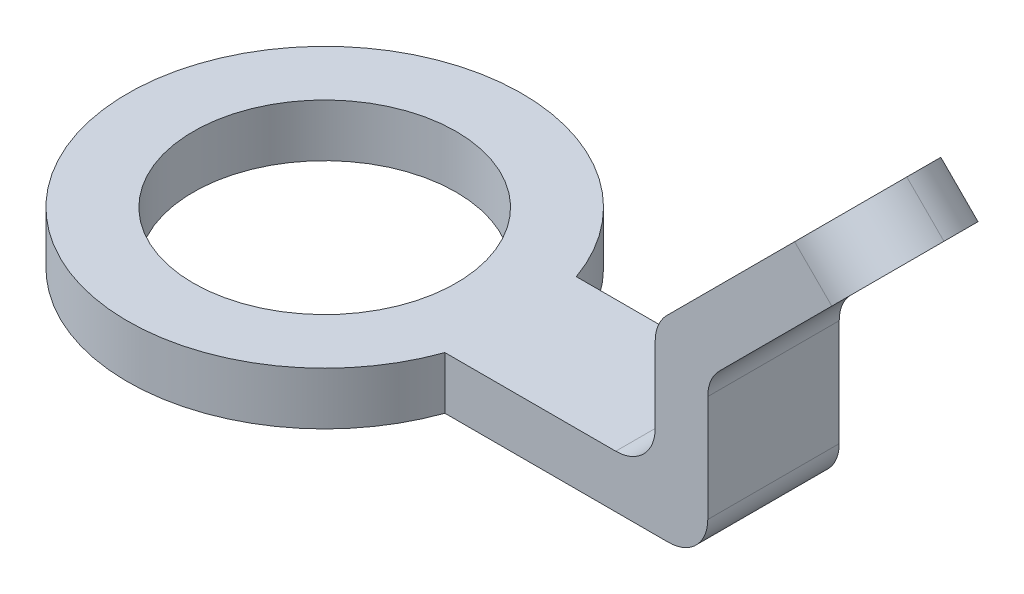
ISO-10303-21;
HEADER;
FILE_DESCRIPTION(('STEP AP214'),'2;1');
FILE_NAME('part.step','',(''),(''),'','','');
FILE_SCHEMA(('AUTOMOTIVE_DESIGN { 1 0 10303 214 1 1 1 1 }'));
ENDSEC;
DATA;
#1=APPLICATION_CONTEXT('core data for automotive mechanical design processes');
#2=APPLICATION_PROTOCOL_DEFINITION('international standard','automotive_design',2000,#1);
#3=PRODUCT_CONTEXT('',#1,'mechanical');
#4=PRODUCT('Part','Part','',(#3));
#5=PRODUCT_RELATED_PRODUCT_CATEGORY('part','',(#4));
#6=PRODUCT_DEFINITION_FORMATION('','',#4);
#7=PRODUCT_DEFINITION_CONTEXT('part definition',#1,'design');
#8=PRODUCT_DEFINITION('design','',#6,#7);
#9=PRODUCT_DEFINITION_SHAPE('','',#8);
#10=(LENGTH_UNIT() NAMED_UNIT(*) SI_UNIT(.MILLI.,.METRE.));
#11=(NAMED_UNIT(*) PLANE_ANGLE_UNIT() SI_UNIT($,.RADIAN.));
#12=(NAMED_UNIT(*) SI_UNIT($,.STERADIAN.) SOLID_ANGLE_UNIT());
#13=UNCERTAINTY_MEASURE_WITH_UNIT(LENGTH_MEASURE(1.E-05),#10,'distance_accuracy_value','');
#14=(GEOMETRIC_REPRESENTATION_CONTEXT(3) GLOBAL_UNCERTAINTY_ASSIGNED_CONTEXT((#13)) GLOBAL_UNIT_ASSIGNED_CONTEXT((#10,
#11,#12)) REPRESENTATION_CONTEXT('',''));
#15=CARTESIAN_POINT('',(0.,0.,0.));
#16=DIRECTION('',(0.,0.,1.));
#17=DIRECTION('',(1.,0.,0.));
#18=AXIS2_PLACEMENT_3D('',#15,#16,#17);
#19=CARTESIAN_POINT('',(0.,4.,0.));
#20=DIRECTION('',(0.,1.,0.));
#21=DIRECTION('',(0.,0.,1.));
#22=AXIS2_PLACEMENT_3D('',#19,#20,#21);
#23=PLANE('',#22);
#24=DIRECTION('',(1.,0.,0.));
#25=VECTOR('',#24,1.);
#26=CARTESIAN_POINT('',(34.142135623731,4.,5.));
#27=LINE('',#26,#25);
#28=CARTESIAN_POINT('',(14.1421356237309,4.,5.00000000000001));
#29=VERTEX_POINT('',#28);
#30=CARTESIAN_POINT('',(27.142135623731,4.,5.00000000000001));
#31=VERTEX_POINT('',#30);
#32=EDGE_CURVE('E147',#29,#31,#27,.T.);
#33=ORIENTED_EDGE('',*,*,#32,.T.);
#34=DIRECTION('',(0.,0.,1.));
#35=VECTOR('',#34,1.);
#36=CARTESIAN_POINT('',(27.142135623731,4.,-4.99999999999999));
#37=LINE('',#36,#35);
#38=CARTESIAN_POINT('',(27.142135623731,4.,-4.99999999999999));
#39=VERTEX_POINT('',#38);
#40=EDGE_CURVE('E54',#31,#39,#37,.F.);
#41=ORIENTED_EDGE('',*,*,#40,.T.);
#42=DIRECTION('',(-1.,0.,0.));
#43=VECTOR('',#42,1.);
#44=CARTESIAN_POINT('',(34.142135623731,4.,-4.99999999999999));
#45=LINE('',#44,#43);
#46=CARTESIAN_POINT('',(14.142135623731,4.,-4.99999999999999));
#47=VERTEX_POINT('',#46);
#48=EDGE_CURVE('E131',#39,#47,#45,.T.);
#49=ORIENTED_EDGE('',*,*,#48,.T.);
#50=CARTESIAN_POINT('',(0.,4.,0.));
#51=DIRECTION('',(0.,1.,0.));
#52=DIRECTION('',(0.,0.,1.));
#53=AXIS2_PLACEMENT_3D('',#50,#51,#52);
#54=CIRCLE('',#53,15.);
#55=EDGE_CURVE('E134',#47,#29,#54,.T.);
#56=ORIENTED_EDGE('',*,*,#55,.T.);
#57=EDGE_LOOP('',(#33,#41,#49,#56));
#58=FACE_BOUND('',#57,.T.);
#59=CARTESIAN_POINT('',(0.,4.,0.));
#60=DIRECTION('',(0.,1.,0.));
#61=DIRECTION('',(0.,0.,1.));
#62=AXIS2_PLACEMENT_3D('',#59,#60,#61);
#63=CIRCLE('',#62,10.);
#64=CARTESIAN_POINT('',(0.,4.,10.));
#65=VERTEX_POINT('',#64);
#66=EDGE_CURVE('E226',#65,#65,#63,.T.);
#67=ORIENTED_EDGE('',*,*,#66,.F.);
#68=EDGE_LOOP('',(#67));
#69=FACE_BOUND('',#68,.T.);
#70=ADVANCED_FACE('F39',(#58,#69),#23,.T.);
#71=CARTESIAN_POINT('',(0.,0.,0.));
#72=DIRECTION('',(0.,1.,0.));
#73=DIRECTION('',(0.,0.,1.));
#74=AXIS2_PLACEMENT_3D('',#71,#72,#73);
#75=PLANE('',#74);
#76=DIRECTION('',(-1.,0.,0.));
#77=VECTOR('',#76,1.);
#78=CARTESIAN_POINT('',(34.142135623731,0.,-4.99999999999999));
#79=LINE('',#78,#77);
#80=CARTESIAN_POINT('',(31.142135623731,0.,-4.99999999999999));
#81=VERTEX_POINT('',#80);
#82=CARTESIAN_POINT('',(14.142135623731,0.,-4.99999999999999));
#83=VERTEX_POINT('',#82);
#84=EDGE_CURVE('E151',#81,#83,#79,.T.);
#85=ORIENTED_EDGE('',*,*,#84,.F.);
#86=DIRECTION('',(0.,0.,-1.));
#87=VECTOR('',#86,1.);
#88=CARTESIAN_POINT('',(31.142135623731,0.,0.));
#89=LINE('',#88,#87);
#90=CARTESIAN_POINT('',(31.142135623731,0.,5.));
#91=VERTEX_POINT('',#90);
#92=EDGE_CURVE('E200',#81,#91,#89,.F.);
#93=ORIENTED_EDGE('',*,*,#92,.T.);
#94=DIRECTION('',(1.,0.,0.));
#95=VECTOR('',#94,1.);
#96=CARTESIAN_POINT('',(34.142135623731,0.,5.));
#97=LINE('',#96,#95);
#98=CARTESIAN_POINT('',(14.1421356237309,0.,5.00000000000001));
#99=VERTEX_POINT('',#98);
#100=EDGE_CURVE('E138',#99,#91,#97,.T.);
#101=ORIENTED_EDGE('',*,*,#100,.F.);
#102=CARTESIAN_POINT('',(0.,0.,0.));
#103=DIRECTION('',(0.,1.,0.));
#104=DIRECTION('',(0.,0.,1.));
#105=AXIS2_PLACEMENT_3D('',#102,#103,#104);
#106=CIRCLE('',#105,15.);
#107=EDGE_CURVE('E240',#83,#99,#106,.T.);
#108=ORIENTED_EDGE('',*,*,#107,.F.);
#109=EDGE_LOOP('',(#85,#93,#101,#108));
#110=FACE_BOUND('',#109,.T.);
#111=CARTESIAN_POINT('',(0.,0.,0.));
#112=DIRECTION('',(0.,1.,0.));
#113=DIRECTION('',(0.,0.,1.));
#114=AXIS2_PLACEMENT_3D('',#111,#112,#113);
#115=CIRCLE('',#114,10.);
#116=CARTESIAN_POINT('',(0.,0.,10.));
#117=VERTEX_POINT('',#116);
#118=EDGE_CURVE('E222',#117,#117,#115,.T.);
#119=ORIENTED_EDGE('',*,*,#118,.T.);
#120=EDGE_LOOP('',(#119));
#121=FACE_BOUND('',#120,.T.);
#122=ADVANCED_FACE('F257',(#110,#121),#75,.F.);
#123=CARTESIAN_POINT('',(34.142135623731,4.,-4.99999999999999));
#124=DIRECTION('',(0.,0.,1.));
#125=DIRECTION('',(1.,0.,0.));
#126=AXIS2_PLACEMENT_3D('',#123,#124,#125);
#127=PLANE('',#126);
#128=DIRECTION('',(0.,-1.,0.));
#129=VECTOR('',#128,1.);
#130=CARTESIAN_POINT('',(30.142135623731,14.,-4.99999999999999));
#131=LINE('',#130,#129);
#132=CARTESIAN_POINT('',(30.142135623731,12.7573593128807,-4.99999999999999));
#133=VERTEX_POINT('',#132);
#134=CARTESIAN_POINT('',(30.142135623731,7.,-4.99999999999999));
#135=VERTEX_POINT('',#134);
#136=EDGE_CURVE('E217',#133,#135,#131,.T.);
#137=ORIENTED_EDGE('',*,*,#136,.F.);
#138=CARTESIAN_POINT('',(33.142135623731,12.7573593128807,-4.99999999999999));
#139=DIRECTION('',(0.,0.,1.));
#140=DIRECTION('',(1.,0.,0.));
#141=AXIS2_PLACEMENT_3D('',#138,#139,#140);
#142=CIRCLE('',#141,3.);
#143=CARTESIAN_POINT('',(31.0208152801713,14.8786796564404,-4.99999999999999));
#144=VERTEX_POINT('',#143);
#145=EDGE_CURVE('E198',#133,#144,#142,.F.);
#146=ORIENTED_EDGE('',*,*,#145,.T.);
#147=DIRECTION('',(-0.707106781186549,-0.707106781186546,0.));
#148=VECTOR('',#147,1.);
#149=CARTESIAN_POINT('',(44.2842712474619,28.1421356237309,-4.99999999999999));
#150=LINE('',#149,#148);
#151=CARTESIAN_POINT('',(40.7487373415292,24.6066017177982,-4.99999999999999));
#152=VERTEX_POINT('',#151);
#153=EDGE_CURVE('E223',#152,#144,#150,.T.);
#154=ORIENTED_EDGE('',*,*,#153,.F.);
#155=DIRECTION('',(-0.707106781186547,0.707106781186548,0.));
#156=VECTOR('',#155,1.);
#157=CARTESIAN_POINT('',(43.5771644662754,21.778174593052,-4.99999999999999));
#158=LINE('',#157,#156);
#159=CARTESIAN_POINT('',(43.5771644662754,21.778174593052,-4.99999999999999));
#160=VERTEX_POINT('',#159);
#161=EDGE_CURVE('E162',#152,#160,#158,.F.);
#162=ORIENTED_EDGE('',*,*,#161,.T.);
#163=DIRECTION('',(0.707106781186548,0.707106781186547,0.));
#164=VECTOR('',#163,1.);
#165=CARTESIAN_POINT('',(34.142135623731,12.3431457505076,-4.99999999999999));
#166=LINE('',#165,#164);
#167=CARTESIAN_POINT('',(35.0208152801713,13.221825406948,-4.99999999999999));
#168=VERTEX_POINT('',#167);
#169=EDGE_CURVE('E229',#168,#160,#166,.T.);
#170=ORIENTED_EDGE('',*,*,#169,.F.);
#171=CARTESIAN_POINT('',(37.142135623731,11.1005050633883,-4.99999999999999));
#172=DIRECTION('',(0.,0.,1.));
#173=DIRECTION('',(1.,0.,0.));
#174=AXIS2_PLACEMENT_3D('',#171,#172,#173);
#175=CIRCLE('',#174,3.);
#176=CARTESIAN_POINT('',(34.142135623731,11.1005050633883,-4.99999999999999));
#177=VERTEX_POINT('',#176);
#178=EDGE_CURVE('E205',#168,#177,#175,.T.);
#179=ORIENTED_EDGE('',*,*,#178,.T.);
#180=DIRECTION('',(0.,-1.,0.));
#181=VECTOR('',#180,1.);
#182=CARTESIAN_POINT('',(34.142135623731,4.,-4.99999999999999));
#183=LINE('',#182,#181);
#184=CARTESIAN_POINT('',(34.142135623731,3.,-4.99999999999999));
#185=VERTEX_POINT('',#184);
#186=EDGE_CURVE('E214',#177,#185,#183,.T.);
#187=ORIENTED_EDGE('',*,*,#186,.T.);
#188=CARTESIAN_POINT('',(31.142135623731,3.,-4.99999999999999));
#189=DIRECTION('',(0.,0.,1.));
#190=DIRECTION('',(1.,0.,0.));
#191=AXIS2_PLACEMENT_3D('',#188,#189,#190);
#192=CIRCLE('',#191,3.);
#193=EDGE_CURVE('E62',#185,#81,#192,.F.);
#194=ORIENTED_EDGE('',*,*,#193,.T.);
#195=ORIENTED_EDGE('',*,*,#84,.T.);
#196=DIRECTION('',(0.,-1.,0.));
#197=VECTOR('',#196,1.);
#198=CARTESIAN_POINT('',(14.142135623731,4.,-4.99999999999999));
#199=LINE('',#198,#197);
#200=EDGE_CURVE('E143',#47,#83,#199,.T.);
#201=ORIENTED_EDGE('',*,*,#200,.F.);
#202=ORIENTED_EDGE('',*,*,#48,.F.);
#203=CARTESIAN_POINT('',(27.142135623731,7.,-4.99999999999999));
#204=DIRECTION('',(0.,0.,1.));
#205=DIRECTION('',(1.,0.,0.));
#206=AXIS2_PLACEMENT_3D('',#203,#204,#205);
#207=CIRCLE('',#206,3.);
#208=EDGE_CURVE('E11',#39,#135,#207,.T.);
#209=ORIENTED_EDGE('',*,*,#208,.T.);
#210=EDGE_LOOP('',(#137,#146,#154,#162,#170,#179,#187,#194,#195,#201,#202,#209));
#211=FACE_BOUND('',#210,.T.);
#212=ADVANCED_FACE('F150',(#211),#127,.F.);
#213=CARTESIAN_POINT('',(0.,4.,0.));
#214=DIRECTION('',(0.,-1.,0.));
#215=DIRECTION('',(0.,0.,-1.));
#216=AXIS2_PLACEMENT_3D('',#213,#214,#215);
#217=CYLINDRICAL_SURFACE('',#216,15.);
#218=ORIENTED_EDGE('',*,*,#107,.T.);
#219=DIRECTION('',(0.,-1.,0.));
#220=VECTOR('',#219,1.);
#221=CARTESIAN_POINT('',(14.1421356237309,4.,5.00000000000001));
#222=LINE('',#221,#220);
#223=EDGE_CURVE('E145',#29,#99,#222,.T.);
#224=ORIENTED_EDGE('',*,*,#223,.F.);
#225=ORIENTED_EDGE('',*,*,#55,.F.);
#226=ORIENTED_EDGE('',*,*,#200,.T.);
#227=EDGE_LOOP('',(#218,#224,#225,#226));
#228=FACE_BOUND('',#227,.T.);
#229=ADVANCED_FACE('F142',(#228),#217,.T.);
#230=CARTESIAN_POINT('',(34.142135623731,4.,5.));
#231=DIRECTION('',(0.,0.,-1.));
#232=DIRECTION('',(-1.,0.,0.));
#233=AXIS2_PLACEMENT_3D('',#230,#231,#232);
#234=PLANE('',#233);
#235=DIRECTION('',(-0.707106781186549,-0.707106781186546,0.));
#236=VECTOR('',#235,1.);
#237=CARTESIAN_POINT('',(44.2842712474619,28.1421356237309,5.00000000000001));
#238=LINE('',#237,#236);
#239=CARTESIAN_POINT('',(40.7487373415292,24.6066017177982,5.00000000000001));
#240=VERTEX_POINT('',#239);
#241=CARTESIAN_POINT('',(31.0208152801713,14.8786796564404,5.00000000000001));
#242=VERTEX_POINT('',#241);
#243=EDGE_CURVE('E234',#240,#242,#238,.T.);
#244=ORIENTED_EDGE('',*,*,#243,.T.);
#245=CARTESIAN_POINT('',(33.142135623731,12.7573593128807,5.00000000000001));
#246=DIRECTION('',(0.,0.,-1.));
#247=DIRECTION('',(-1.,0.,0.));
#248=AXIS2_PLACEMENT_3D('',#245,#246,#247);
#249=CIRCLE('',#248,3.);
#250=CARTESIAN_POINT('',(30.142135623731,12.7573593128807,5.00000000000001));
#251=VERTEX_POINT('',#250);
#252=EDGE_CURVE('E190',#242,#251,#249,.F.);
#253=ORIENTED_EDGE('',*,*,#252,.T.);
#254=DIRECTION('',(0.,-1.,0.));
#255=VECTOR('',#254,1.);
#256=CARTESIAN_POINT('',(30.142135623731,14.,5.00000000000001));
#257=LINE('',#256,#255);
#258=CARTESIAN_POINT('',(30.142135623731,7.,5.00000000000001));
#259=VERTEX_POINT('',#258);
#260=EDGE_CURVE('E211',#251,#259,#257,.T.);
#261=ORIENTED_EDGE('',*,*,#260,.T.);
#262=CARTESIAN_POINT('',(27.142135623731,7.,5.00000000000001));
#263=DIRECTION('',(0.,0.,-1.));
#264=DIRECTION('',(-1.,0.,0.));
#265=AXIS2_PLACEMENT_3D('',#262,#263,#264);
#266=CIRCLE('',#265,3.);
#267=EDGE_CURVE('E47',#259,#31,#266,.T.);
#268=ORIENTED_EDGE('',*,*,#267,.T.);
#269=ORIENTED_EDGE('',*,*,#32,.F.);
#270=ORIENTED_EDGE('',*,*,#223,.T.);
#271=ORIENTED_EDGE('',*,*,#100,.T.);
#272=CARTESIAN_POINT('',(31.142135623731,3.,5.));
#273=DIRECTION('',(0.,0.,-1.));
#274=DIRECTION('',(-1.,0.,0.));
#275=AXIS2_PLACEMENT_3D('',#272,#273,#274);
#276=CIRCLE('',#275,3.);
#277=CARTESIAN_POINT('',(34.142135623731,3.,5.));
#278=VERTEX_POINT('',#277);
#279=EDGE_CURVE('E188',#91,#278,#276,.F.);
#280=ORIENTED_EDGE('',*,*,#279,.T.);
#281=DIRECTION('',(0.,-1.,0.));
#282=VECTOR('',#281,1.);
#283=CARTESIAN_POINT('',(34.142135623731,4.,5.));
#284=LINE('',#283,#282);
#285=CARTESIAN_POINT('',(34.142135623731,11.1005050633883,5.));
#286=VERTEX_POINT('',#285);
#287=EDGE_CURVE('E157',#286,#278,#284,.T.);
#288=ORIENTED_EDGE('',*,*,#287,.F.);
#289=CARTESIAN_POINT('',(37.142135623731,11.1005050633883,5.));
#290=DIRECTION('',(0.,0.,-1.));
#291=DIRECTION('',(-1.,0.,0.));
#292=AXIS2_PLACEMENT_3D('',#289,#290,#291);
#293=CIRCLE('',#292,3.);
#294=CARTESIAN_POINT('',(35.0208152801713,13.221825406948,5.00000000000001));
#295=VERTEX_POINT('',#294);
#296=EDGE_CURVE('E203',#286,#295,#293,.T.);
#297=ORIENTED_EDGE('',*,*,#296,.T.);
#298=DIRECTION('',(0.707106781186548,0.707106781186547,0.));
#299=VECTOR('',#298,1.);
#300=CARTESIAN_POINT('',(34.142135623731,12.3431457505076,5.00000000000001));
#301=LINE('',#300,#299);
#302=CARTESIAN_POINT('',(43.5771644662754,21.778174593052,5.00000000000001));
#303=VERTEX_POINT('',#302);
#304=EDGE_CURVE('E176',#295,#303,#301,.T.);
#305=ORIENTED_EDGE('',*,*,#304,.T.);
#306=DIRECTION('',(-0.707106781186547,0.707106781186548,0.));
#307=VECTOR('',#306,1.);
#308=CARTESIAN_POINT('',(40.7487373415292,24.6066017177982,5.));
#309=LINE('',#308,#307);
#310=EDGE_CURVE('E170',#303,#240,#309,.T.);
#311=ORIENTED_EDGE('',*,*,#310,.T.);
#312=EDGE_LOOP('',(#244,#253,#261,#268,#269,#270,#271,#280,#288,#297,#305,#311));
#313=FACE_BOUND('',#312,.T.);
#314=ADVANCED_FACE('F209',(#313),#234,.F.);
#315=CARTESIAN_POINT('',(34.142135623731,4.,-4.99999999999999));
#316=DIRECTION('',(-1.,0.,0.));
#317=DIRECTION('',(0.,0.,1.));
#318=AXIS2_PLACEMENT_3D('',#315,#316,#317);
#319=PLANE('',#318);
#320=ORIENTED_EDGE('',*,*,#186,.F.);
#321=DIRECTION('',(0.,0.,1.));
#322=VECTOR('',#321,1.);
#323=CARTESIAN_POINT('',(34.142135623731,11.1005050633883,-4.99999999999999));
#324=LINE('',#323,#322);
#325=EDGE_CURVE('E180',#177,#286,#324,.T.);
#326=ORIENTED_EDGE('',*,*,#325,.T.);
#327=ORIENTED_EDGE('',*,*,#287,.T.);
#328=DIRECTION('',(0.,0.,-1.));
#329=VECTOR('',#328,1.);
#330=CARTESIAN_POINT('',(34.142135623731,3.,-4.99999999999999));
#331=LINE('',#330,#329);
#332=EDGE_CURVE('E172',#278,#185,#331,.T.);
#333=ORIENTED_EDGE('',*,*,#332,.T.);
#334=EDGE_LOOP('',(#320,#326,#327,#333));
#335=FACE_BOUND('',#334,.T.);
#336=ADVANCED_FACE('F249',(#335),#319,.F.);
#337=CARTESIAN_POINT('',(0.,4.,0.));
#338=DIRECTION('',(0.,-1.,0.));
#339=DIRECTION('',(0.,0.,-1.));
#340=AXIS2_PLACEMENT_3D('',#337,#338,#339);
#341=CYLINDRICAL_SURFACE('',#340,10.);
#342=ORIENTED_EDGE('',*,*,#66,.T.);
#343=EDGE_LOOP('',(#342));
#344=FACE_BOUND('',#343,.T.);
#345=ORIENTED_EDGE('',*,*,#118,.F.);
#346=EDGE_LOOP('',(#345));
#347=FACE_BOUND('',#346,.T.);
#348=ADVANCED_FACE('F263',(#344,#347),#341,.F.);
#349=CARTESIAN_POINT('',(30.142135623731,14.,-4.99999999999999));
#350=DIRECTION('',(-1.,0.,0.));
#351=DIRECTION('',(0.,0.,1.));
#352=AXIS2_PLACEMENT_3D('',#349,#350,#351);
#353=PLANE('',#352);
#354=ORIENTED_EDGE('',*,*,#260,.F.);
#355=DIRECTION('',(0.,0.,1.));
#356=VECTOR('',#355,1.);
#357=CARTESIAN_POINT('',(30.142135623731,12.7573593128807,-4.99999999999999));
#358=LINE('',#357,#356);
#359=EDGE_CURVE('E195',#251,#133,#358,.F.);
#360=ORIENTED_EDGE('',*,*,#359,.T.);
#361=ORIENTED_EDGE('',*,*,#136,.T.);
#362=DIRECTION('',(0.,0.,1.));
#363=VECTOR('',#362,1.);
#364=CARTESIAN_POINT('',(30.142135623731,7.,5.00000000000001));
#365=LINE('',#364,#363);
#366=EDGE_CURVE('E192',#135,#259,#365,.T.);
#367=ORIENTED_EDGE('',*,*,#366,.T.);
#368=EDGE_LOOP('',(#354,#360,#361,#367));
#369=FACE_BOUND('',#368,.T.);
#370=ADVANCED_FACE('F220',(#369),#353,.T.);
#371=CARTESIAN_POINT('',(44.2842712474619,28.1421356237309,-4.99999999999999));
#372=DIRECTION('',(-0.707106781186546,0.707106781186549,0.));
#373=DIRECTION('',(-0.707106781186549,-0.707106781186546,0.));
#374=AXIS2_PLACEMENT_3D('',#371,#372,#373);
#375=PLANE('',#374);
#376=CARTESIAN_POINT('',(40.7487373415292,24.6066017177982,0.));
#377=DIRECTION('',(-0.707106781186546,0.707106781186549,0.));
#378=DIRECTION('',(-0.707106781186549,-0.707106781186546,0.));
#379=AXIS2_PLACEMENT_3D('',#376,#377,#378);
#380=CIRCLE('',#379,1.8);
#381=CARTESIAN_POINT('',(39.4759451353934,23.3338095116624,0.));
#382=VERTEX_POINT('',#381);
#383=EDGE_CURVE('E423',#382,#382,#380,.T.);
#384=ORIENTED_EDGE('',*,*,#383,.F.);
#385=EDGE_LOOP('',(#384));
#386=FACE_BOUND('',#385,.T.);
#387=ORIENTED_EDGE('',*,*,#153,.T.);
#388=DIRECTION('',(0.,0.,1.));
#389=VECTOR('',#388,1.);
#390=CARTESIAN_POINT('',(31.0208152801713,14.8786796564404,-4.99999999999999));
#391=LINE('',#390,#389);
#392=EDGE_CURVE('E185',#144,#242,#391,.T.);
#393=ORIENTED_EDGE('',*,*,#392,.T.);
#394=ORIENTED_EDGE('',*,*,#243,.F.);
#395=CARTESIAN_POINT('',(40.7487373415292,24.6066017177982,0.));
#396=DIRECTION('',(-0.707106781186546,0.707106781186549,0.));
#397=DIRECTION('',(-0.707106781186549,-0.707106781186546,0.));
#398=AXIS2_PLACEMENT_3D('',#395,#396,#397);
#399=CIRCLE('',#398,5.);
#400=CARTESIAN_POINT('',(44.2842712474619,28.1421356237309,0.));
#401=VERTEX_POINT('',#400);
#402=EDGE_CURVE('E153',#240,#401,#399,.T.);
#403=ORIENTED_EDGE('',*,*,#402,.T.);
#404=CARTESIAN_POINT('',(40.7487373415292,24.6066017177982,0.));
#405=DIRECTION('',(-0.707106781186546,0.707106781186549,0.));
#406=DIRECTION('',(-0.707106781186549,-0.707106781186546,0.));
#407=AXIS2_PLACEMENT_3D('',#404,#405,#406);
#408=CIRCLE('',#407,5.);
#409=EDGE_CURVE('E155',#401,#152,#408,.T.);
#410=ORIENTED_EDGE('',*,*,#409,.T.);
#411=EDGE_LOOP('',(#387,#393,#394,#403,#410));
#412=FACE_BOUND('',#411,.T.);
#413=ADVANCED_FACE('F272',(#386,#412),#375,.T.);
#414=CARTESIAN_POINT('',(34.142135623731,12.3431457505076,-4.99999999999999));
#415=DIRECTION('',(0.707106781186547,-0.707106781186548,0.));
#416=DIRECTION('',(0.707106781186548,0.707106781186547,0.));
#417=AXIS2_PLACEMENT_3D('',#414,#415,#416);
#418=PLANE('',#417);
#419=CARTESIAN_POINT('',(43.5771644662754,21.778174593052,0.));
#420=DIRECTION('',(0.707106781186547,-0.707106781186548,0.));
#421=DIRECTION('',(0.707106781186548,0.707106781186547,0.));
#422=AXIS2_PLACEMENT_3D('',#419,#420,#421);
#423=CIRCLE('',#422,1.8);
#424=CARTESIAN_POINT('',(44.8499566724112,23.0509667991878,0.));
#425=VERTEX_POINT('',#424);
#426=EDGE_CURVE('E177',#425,#425,#423,.T.);
#427=ORIENTED_EDGE('',*,*,#426,.F.);
#428=EDGE_LOOP('',(#427));
#429=FACE_BOUND('',#428,.T.);
#430=ORIENTED_EDGE('',*,*,#304,.F.);
#431=DIRECTION('',(0.,0.,1.));
#432=VECTOR('',#431,1.);
#433=CARTESIAN_POINT('',(35.0208152801713,13.221825406948,-4.99999999999999));
#434=LINE('',#433,#432);
#435=EDGE_CURVE('E183',#295,#168,#434,.F.);
#436=ORIENTED_EDGE('',*,*,#435,.T.);
#437=ORIENTED_EDGE('',*,*,#169,.T.);
#438=CARTESIAN_POINT('',(43.5771644662754,21.778174593052,0.));
#439=DIRECTION('',(0.707106781186547,-0.707106781186548,0.));
#440=DIRECTION('',(0.707106781186548,0.707106781186547,0.));
#441=AXIS2_PLACEMENT_3D('',#438,#439,#440);
#442=CIRCLE('',#441,5.);
#443=CARTESIAN_POINT('',(47.1126983722081,25.3137084989847,0.));
#444=VERTEX_POINT('',#443);
#445=EDGE_CURVE('E168',#160,#444,#442,.T.);
#446=ORIENTED_EDGE('',*,*,#445,.T.);
#447=CARTESIAN_POINT('',(43.5771644662754,21.778174593052,0.));
#448=DIRECTION('',(0.707106781186547,-0.707106781186548,0.));
#449=DIRECTION('',(0.707106781186548,0.707106781186547,0.));
#450=AXIS2_PLACEMENT_3D('',#447,#448,#449);
#451=CIRCLE('',#450,5.);
#452=EDGE_CURVE('E165',#444,#303,#451,.T.);
#453=ORIENTED_EDGE('',*,*,#452,.T.);
#454=EDGE_LOOP('',(#430,#436,#437,#446,#453));
#455=FACE_BOUND('',#454,.T.);
#456=ADVANCED_FACE('F295',(#429,#455),#418,.T.);
#457=CARTESIAN_POINT('',(47.7487373415292,17.6066017177982,0.));
#458=DIRECTION('',(0.707106781186547,-0.707106781186548,0.));
#459=DIRECTION('',(0.707106781186548,0.707106781186547,0.));
#460=AXIS2_PLACEMENT_3D('',#457,#458,#459);
#461=CYLINDRICAL_SURFACE('',#460,5.);
#462=ORIENTED_EDGE('',*,*,#310,.F.);
#463=ORIENTED_EDGE('',*,*,#452,.F.);
#464=DIRECTION('',(-0.707106781186547,0.707106781186548,0.));
#465=VECTOR('',#464,1.);
#466=CARTESIAN_POINT('',(47.1126983722081,25.3137084989847,0.));
#467=LINE('',#466,#465);
#468=EDGE_CURVE('E173',#401,#444,#467,.F.);
#469=ORIENTED_EDGE('',*,*,#468,.F.);
#470=ORIENTED_EDGE('',*,*,#402,.F.);
#471=EDGE_LOOP('',(#462,#463,#469,#470));
#472=FACE_BOUND('',#471,.T.);
#473=ADVANCED_FACE('F292',(#472),#461,.T.);
#474=CARTESIAN_POINT('',(43.5771644662754,21.778174593052,0.));
#475=DIRECTION('',(0.707106781186547,-0.707106781186548,0.));
#476=DIRECTION('',(0.707106781186548,0.707106781186547,0.));
#477=AXIS2_PLACEMENT_3D('',#474,#475,#476);
#478=CYLINDRICAL_SURFACE('',#477,5.);
#479=ORIENTED_EDGE('',*,*,#445,.F.);
#480=ORIENTED_EDGE('',*,*,#161,.F.);
#481=ORIENTED_EDGE('',*,*,#409,.F.);
#482=ORIENTED_EDGE('',*,*,#468,.T.);
#483=EDGE_LOOP('',(#479,#480,#481,#482));
#484=FACE_BOUND('',#483,.T.);
#485=ADVANCED_FACE('F288',(#484),#478,.T.);
#486=CARTESIAN_POINT('',(40.7487373415292,24.6066017177982,0.));
#487=DIRECTION('',(-0.707106781186546,0.707106781186549,0.));
#488=DIRECTION('',(-0.707106781186549,-0.707106781186546,0.));
#489=AXIS2_PLACEMENT_3D('',#486,#487,#488);
#490=CYLINDRICAL_SURFACE('',#489,1.8);
#491=ORIENTED_EDGE('',*,*,#426,.T.);
#492=EDGE_LOOP('',(#491));
#493=FACE_BOUND('',#492,.T.);
#494=ORIENTED_EDGE('',*,*,#383,.T.);
#495=EDGE_LOOP('',(#494));
#496=FACE_BOUND('',#495,.T.);
#497=ADVANCED_FACE('F291',(#493,#496),#490,.F.);
#498=CARTESIAN_POINT('',(37.142135623731,11.1005050633883,-4.99999999999999));
#499=DIRECTION('',(0.,0.,1.));
#500=DIRECTION('',(1.,0.,0.));
#501=AXIS2_PLACEMENT_3D('',#498,#499,#500);
#502=CYLINDRICAL_SURFACE('',#501,3.);
#503=ORIENTED_EDGE('',*,*,#178,.F.);
#504=ORIENTED_EDGE('',*,*,#435,.F.);
#505=ORIENTED_EDGE('',*,*,#296,.F.);
#506=ORIENTED_EDGE('',*,*,#325,.F.);
#507=EDGE_LOOP('',(#503,#504,#505,#506));
#508=FACE_BOUND('',#507,.T.);
#509=ADVANCED_FACE('F297',(#508),#502,.F.);
#510=CARTESIAN_POINT('',(33.142135623731,12.7573593128807,-4.99999999999999));
#511=DIRECTION('',(0.,0.,1.));
#512=DIRECTION('',(1.,0.,0.));
#513=AXIS2_PLACEMENT_3D('',#510,#511,#512);
#514=CYLINDRICAL_SURFACE('',#513,3.);
#515=ORIENTED_EDGE('',*,*,#145,.F.);
#516=ORIENTED_EDGE('',*,*,#359,.F.);
#517=ORIENTED_EDGE('',*,*,#252,.F.);
#518=ORIENTED_EDGE('',*,*,#392,.F.);
#519=EDGE_LOOP('',(#515,#516,#517,#518));
#520=FACE_BOUND('',#519,.T.);
#521=ADVANCED_FACE('F300',(#520),#514,.T.);
#522=CARTESIAN_POINT('',(31.142135623731,3.,-4.99999999999999));
#523=DIRECTION('',(0.,0.,-1.));
#524=DIRECTION('',(-1.,0.,0.));
#525=AXIS2_PLACEMENT_3D('',#522,#523,#524);
#526=CYLINDRICAL_SURFACE('',#525,3.);
#527=ORIENTED_EDGE('',*,*,#279,.F.);
#528=ORIENTED_EDGE('',*,*,#92,.F.);
#529=ORIENTED_EDGE('',*,*,#193,.F.);
#530=ORIENTED_EDGE('',*,*,#332,.F.);
#531=EDGE_LOOP('',(#527,#528,#529,#530));
#532=FACE_BOUND('',#531,.T.);
#533=ADVANCED_FACE('F253',(#532),#526,.T.);
#534=CARTESIAN_POINT('',(27.142135623731,7.,-4.99999999999999));
#535=DIRECTION('',(0.,0.,-1.));
#536=DIRECTION('',(-1.,0.,0.));
#537=AXIS2_PLACEMENT_3D('',#534,#535,#536);
#538=CYLINDRICAL_SURFACE('',#537,3.);
#539=ORIENTED_EDGE('',*,*,#208,.F.);
#540=ORIENTED_EDGE('',*,*,#40,.F.);
#541=ORIENTED_EDGE('',*,*,#267,.F.);
#542=ORIENTED_EDGE('',*,*,#366,.F.);
#543=EDGE_LOOP('',(#539,#540,#541,#542));
#544=FACE_BOUND('',#543,.T.);
#545=ADVANCED_FACE('F41',(#544),#538,.F.);
#546=CLOSED_SHELL('',(#70,#122,#212,#229,#314,#336,#348,#370,#413,#456,#473,#485,#497,#509,#521,
#533,#545));
#547=MANIFOLD_SOLID_BREP('B2',#546);
#548=ADVANCED_BREP_SHAPE_REPRESENTATION('',(#18,#547),#14);
#549=SHAPE_DEFINITION_REPRESENTATION(#9,#548);
ENDSEC;
END-ISO-10303-21;
